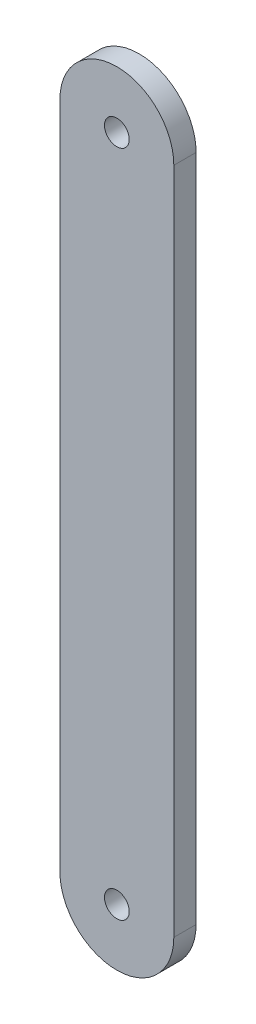
ISO-10303-21;
HEADER;
FILE_DESCRIPTION(('STEP AP214'),'2;1');
FILE_NAME('part.step','',(''),(''),'','','');
FILE_SCHEMA(('AUTOMOTIVE_DESIGN { 1 0 10303 214 1 1 1 1 }'));
ENDSEC;
DATA;
#1=APPLICATION_CONTEXT('core data for automotive mechanical design processes');
#2=APPLICATION_PROTOCOL_DEFINITION('international standard','automotive_design',2000,#1);
#3=PRODUCT_CONTEXT('',#1,'mechanical');
#4=PRODUCT('Part','Part','',(#3));
#5=PRODUCT_RELATED_PRODUCT_CATEGORY('part','',(#4));
#6=PRODUCT_DEFINITION_FORMATION('','',#4);
#7=PRODUCT_DEFINITION_CONTEXT('part definition',#1,'design');
#8=PRODUCT_DEFINITION('design','',#6,#7);
#9=PRODUCT_DEFINITION_SHAPE('','',#8);
#10=(LENGTH_UNIT() NAMED_UNIT(*) SI_UNIT(.MILLI.,.METRE.));
#11=(NAMED_UNIT(*) PLANE_ANGLE_UNIT() SI_UNIT($,.RADIAN.));
#12=(NAMED_UNIT(*) SI_UNIT($,.STERADIAN.) SOLID_ANGLE_UNIT());
#13=UNCERTAINTY_MEASURE_WITH_UNIT(LENGTH_MEASURE(1.E-05),#10,'distance_accuracy_value','');
#14=(GEOMETRIC_REPRESENTATION_CONTEXT(3) GLOBAL_UNCERTAINTY_ASSIGNED_CONTEXT((#13)) GLOBAL_UNIT_ASSIGNED_CONTEXT((#10,
#11,#12)) REPRESENTATION_CONTEXT('',''));
#15=CARTESIAN_POINT('',(0.,0.,0.));
#16=DIRECTION('',(0.,0.,1.));
#17=DIRECTION('',(1.,0.,0.));
#18=AXIS2_PLACEMENT_3D('',#15,#16,#17);
#19=CARTESIAN_POINT('',(12.78,0.,2.5));
#20=DIRECTION('',(-1.,0.,0.));
#21=DIRECTION('',(0.,-1.,0.));
#22=AXIS2_PLACEMENT_3D('',#19,#20,#21);
#23=PLANE('',#22);
#24=DIRECTION('',(0.,1.,0.));
#25=VECTOR('',#24,1.);
#26=CARTESIAN_POINT('',(12.78,0.,-2.5));
#27=LINE('',#26,#25);
#28=CARTESIAN_POINT('',(12.78,0.,-2.5));
#29=VERTEX_POINT('',#28);
#30=CARTESIAN_POINT('',(12.78,150.,-2.5));
#31=VERTEX_POINT('',#30);
#32=EDGE_CURVE('E105',#29,#31,#27,.T.);
#33=ORIENTED_EDGE('',*,*,#32,.T.);
#34=DIRECTION('',(0.,0.,-1.));
#35=VECTOR('',#34,1.);
#36=CARTESIAN_POINT('',(12.78,150.,2.5));
#37=LINE('',#36,#35);
#38=CARTESIAN_POINT('',(12.78,150.,2.5));
#39=VERTEX_POINT('',#38);
#40=EDGE_CURVE('E11',#39,#31,#37,.T.);
#41=ORIENTED_EDGE('',*,*,#40,.F.);
#42=DIRECTION('',(0.,1.,0.));
#43=VECTOR('',#42,1.);
#44=CARTESIAN_POINT('',(12.78,0.,2.5));
#45=LINE('',#44,#43);
#46=CARTESIAN_POINT('',(12.78,0.,2.5));
#47=VERTEX_POINT('',#46);
#48=EDGE_CURVE('E87',#47,#39,#45,.T.);
#49=ORIENTED_EDGE('',*,*,#48,.F.);
#50=DIRECTION('',(0.,0.,-1.));
#51=VECTOR('',#50,1.);
#52=CARTESIAN_POINT('',(12.78,0.,2.5));
#53=LINE('',#52,#51);
#54=EDGE_CURVE('E104',#47,#29,#53,.T.);
#55=ORIENTED_EDGE('',*,*,#54,.T.);
#56=EDGE_LOOP('',(#33,#41,#49,#55));
#57=FACE_BOUND('',#56,.T.);
#58=ADVANCED_FACE('F35',(#57),#23,.F.);
#59=CARTESIAN_POINT('',(0.,150.,2.5));
#60=DIRECTION('',(0.,0.,-1.));
#61=DIRECTION('',(-1.,0.,0.));
#62=AXIS2_PLACEMENT_3D('',#59,#60,#61);
#63=CYLINDRICAL_SURFACE('',#62,12.78);
#64=CARTESIAN_POINT('',(0.,150.,-2.5));
#65=DIRECTION('',(0.,0.,1.));
#66=DIRECTION('',(1.,0.,0.));
#67=AXIS2_PLACEMENT_3D('',#64,#65,#66);
#68=CIRCLE('',#67,12.78);
#69=CARTESIAN_POINT('',(-12.78,150.,-2.5));
#70=VERTEX_POINT('',#69);
#71=EDGE_CURVE('E91',#31,#70,#68,.T.);
#72=ORIENTED_EDGE('',*,*,#71,.T.);
#73=DIRECTION('',(0.,0.,-1.));
#74=VECTOR('',#73,1.);
#75=CARTESIAN_POINT('',(-12.78,150.,2.5));
#76=LINE('',#75,#74);
#77=CARTESIAN_POINT('',(-12.78,150.,2.5));
#78=VERTEX_POINT('',#77);
#79=EDGE_CURVE('E43',#78,#70,#76,.T.);
#80=ORIENTED_EDGE('',*,*,#79,.F.);
#81=CARTESIAN_POINT('',(0.,150.,2.5));
#82=DIRECTION('',(0.,0.,1.));
#83=DIRECTION('',(1.,0.,0.));
#84=AXIS2_PLACEMENT_3D('',#81,#82,#83);
#85=CIRCLE('',#84,12.78);
#86=EDGE_CURVE('E81',#39,#78,#85,.T.);
#87=ORIENTED_EDGE('',*,*,#86,.F.);
#88=ORIENTED_EDGE('',*,*,#40,.T.);
#89=EDGE_LOOP('',(#72,#80,#87,#88));
#90=FACE_BOUND('',#89,.T.);
#91=ADVANCED_FACE('F90',(#90),#63,.T.);
#92=CARTESIAN_POINT('',(-12.78,0.,2.5));
#93=DIRECTION('',(1.,0.,0.));
#94=DIRECTION('',(0.,1.,0.));
#95=AXIS2_PLACEMENT_3D('',#92,#93,#94);
#96=PLANE('',#95);
#97=DIRECTION('',(0.,-1.,0.));
#98=VECTOR('',#97,1.);
#99=CARTESIAN_POINT('',(-12.78,0.,-2.5));
#100=LINE('',#99,#98);
#101=CARTESIAN_POINT('',(-12.78,0.,-2.5));
#102=VERTEX_POINT('',#101);
#103=EDGE_CURVE('E68',#70,#102,#100,.T.);
#104=ORIENTED_EDGE('',*,*,#103,.T.);
#105=DIRECTION('',(0.,0.,-1.));
#106=VECTOR('',#105,1.);
#107=CARTESIAN_POINT('',(-12.78,0.,2.5));
#108=LINE('',#107,#106);
#109=CARTESIAN_POINT('',(-12.78,0.,2.5));
#110=VERTEX_POINT('',#109);
#111=EDGE_CURVE('E92',#110,#102,#108,.T.);
#112=ORIENTED_EDGE('',*,*,#111,.F.);
#113=DIRECTION('',(0.,-1.,0.));
#114=VECTOR('',#113,1.);
#115=CARTESIAN_POINT('',(-12.78,0.,2.5));
#116=LINE('',#115,#114);
#117=EDGE_CURVE('E85',#78,#110,#116,.T.);
#118=ORIENTED_EDGE('',*,*,#117,.F.);
#119=ORIENTED_EDGE('',*,*,#79,.T.);
#120=EDGE_LOOP('',(#104,#112,#118,#119));
#121=FACE_BOUND('',#120,.T.);
#122=ADVANCED_FACE('F93',(#121),#96,.F.);
#123=CARTESIAN_POINT('',(0.,0.,2.5));
#124=DIRECTION('',(0.,0.,-1.));
#125=DIRECTION('',(-1.,0.,0.));
#126=AXIS2_PLACEMENT_3D('',#123,#124,#125);
#127=CYLINDRICAL_SURFACE('',#126,2.78);
#128=CARTESIAN_POINT('',(0.,0.,2.5));
#129=DIRECTION('',(0.,0.,1.));
#130=DIRECTION('',(1.,0.,0.));
#131=AXIS2_PLACEMENT_3D('',#128,#129,#130);
#132=CIRCLE('',#131,2.78);
#133=CARTESIAN_POINT('',(2.78,0.,2.5));
#134=VERTEX_POINT('',#133);
#135=EDGE_CURVE('E95',#134,#134,#132,.T.);
#136=ORIENTED_EDGE('',*,*,#135,.T.);
#137=EDGE_LOOP('',(#136));
#138=FACE_BOUND('',#137,.T.);
#139=CARTESIAN_POINT('',(0.,0.,-2.5));
#140=DIRECTION('',(0.,0.,1.));
#141=DIRECTION('',(1.,0.,0.));
#142=AXIS2_PLACEMENT_3D('',#139,#140,#141);
#143=CIRCLE('',#142,2.78);
#144=CARTESIAN_POINT('',(2.78,0.,-2.5));
#145=VERTEX_POINT('',#144);
#146=EDGE_CURVE('E111',#145,#145,#143,.T.);
#147=ORIENTED_EDGE('',*,*,#146,.F.);
#148=EDGE_LOOP('',(#147));
#149=FACE_BOUND('',#148,.T.);
#150=ADVANCED_FACE('F131',(#138,#149),#127,.F.);
#151=CARTESIAN_POINT('',(0.,0.,2.5));
#152=DIRECTION('',(0.,0.,-1.));
#153=DIRECTION('',(-1.,0.,0.));
#154=AXIS2_PLACEMENT_3D('',#151,#152,#153);
#155=CYLINDRICAL_SURFACE('',#154,12.78);
#156=CARTESIAN_POINT('',(0.,0.,-2.5));
#157=DIRECTION('',(0.,0.,1.));
#158=DIRECTION('',(1.,0.,0.));
#159=AXIS2_PLACEMENT_3D('',#156,#157,#158);
#160=CIRCLE('',#159,12.78);
#161=EDGE_CURVE('E74',#102,#29,#160,.T.);
#162=ORIENTED_EDGE('',*,*,#161,.T.);
#163=ORIENTED_EDGE('',*,*,#54,.F.);
#164=CARTESIAN_POINT('',(0.,0.,2.5));
#165=DIRECTION('',(0.,0.,1.));
#166=DIRECTION('',(1.,0.,0.));
#167=AXIS2_PLACEMENT_3D('',#164,#165,#166);
#168=CIRCLE('',#167,12.78);
#169=EDGE_CURVE('E51',#110,#47,#168,.T.);
#170=ORIENTED_EDGE('',*,*,#169,.F.);
#171=ORIENTED_EDGE('',*,*,#111,.T.);
#172=EDGE_LOOP('',(#162,#163,#170,#171));
#173=FACE_BOUND('',#172,.T.);
#174=ADVANCED_FACE('F118',(#173),#155,.T.);
#175=CARTESIAN_POINT('',(0.,150.,2.5));
#176=DIRECTION('',(0.,0.,-1.));
#177=DIRECTION('',(-1.,0.,0.));
#178=AXIS2_PLACEMENT_3D('',#175,#176,#177);
#179=CYLINDRICAL_SURFACE('',#178,2.77999999999999);
#180=CARTESIAN_POINT('',(0.,150.,2.5));
#181=DIRECTION('',(0.,0.,1.));
#182=DIRECTION('',(1.,0.,0.));
#183=AXIS2_PLACEMENT_3D('',#180,#181,#182);
#184=CIRCLE('',#183,2.77999999999999);
#185=CARTESIAN_POINT('',(2.77999999999999,150.,2.5));
#186=VERTEX_POINT('',#185);
#187=EDGE_CURVE('E101',#186,#186,#184,.T.);
#188=ORIENTED_EDGE('',*,*,#187,.T.);
#189=EDGE_LOOP('',(#188));
#190=FACE_BOUND('',#189,.T.);
#191=CARTESIAN_POINT('',(0.,150.,-2.5));
#192=DIRECTION('',(0.,0.,1.));
#193=DIRECTION('',(1.,0.,0.));
#194=AXIS2_PLACEMENT_3D('',#191,#192,#193);
#195=CIRCLE('',#194,2.77999999999999);
#196=CARTESIAN_POINT('',(2.77999999999999,150.,-2.5));
#197=VERTEX_POINT('',#196);
#198=EDGE_CURVE('E114',#197,#197,#195,.T.);
#199=ORIENTED_EDGE('',*,*,#198,.F.);
#200=EDGE_LOOP('',(#199));
#201=FACE_BOUND('',#200,.T.);
#202=ADVANCED_FACE('F136',(#190,#201),#179,.F.);
#203=CARTESIAN_POINT('',(0.,0.,2.5));
#204=DIRECTION('',(0.,0.,1.));
#205=DIRECTION('',(1.,0.,0.));
#206=AXIS2_PLACEMENT_3D('',#203,#204,#205);
#207=PLANE('',#206);
#208=ORIENTED_EDGE('',*,*,#48,.T.);
#209=ORIENTED_EDGE('',*,*,#86,.T.);
#210=ORIENTED_EDGE('',*,*,#117,.T.);
#211=ORIENTED_EDGE('',*,*,#169,.T.);
#212=EDGE_LOOP('',(#208,#209,#210,#211));
#213=FACE_BOUND('',#212,.T.);
#214=ORIENTED_EDGE('',*,*,#135,.F.);
#215=EDGE_LOOP('',(#214));
#216=FACE_BOUND('',#215,.T.);
#217=ORIENTED_EDGE('',*,*,#187,.F.);
#218=EDGE_LOOP('',(#217));
#219=FACE_BOUND('',#218,.T.);
#220=ADVANCED_FACE('F82',(#213,#216,#219),#207,.T.);
#221=CARTESIAN_POINT('',(0.,0.,-2.5));
#222=DIRECTION('',(0.,0.,1.));
#223=DIRECTION('',(1.,0.,0.));
#224=AXIS2_PLACEMENT_3D('',#221,#222,#223);
#225=PLANE('',#224);
#226=ORIENTED_EDGE('',*,*,#32,.F.);
#227=ORIENTED_EDGE('',*,*,#161,.F.);
#228=ORIENTED_EDGE('',*,*,#103,.F.);
#229=ORIENTED_EDGE('',*,*,#71,.F.);
#230=EDGE_LOOP('',(#226,#227,#228,#229));
#231=FACE_BOUND('',#230,.T.);
#232=ORIENTED_EDGE('',*,*,#146,.T.);
#233=EDGE_LOOP('',(#232));
#234=FACE_BOUND('',#233,.T.);
#235=ORIENTED_EDGE('',*,*,#198,.T.);
#236=EDGE_LOOP('',(#235));
#237=FACE_BOUND('',#236,.T.);
#238=ADVANCED_FACE('F121',(#231,#234,#237),#225,.F.);
#239=CLOSED_SHELL('',(#58,#91,#122,#150,#174,#202,#220,#238));
#240=MANIFOLD_SOLID_BREP('B2',#239);
#241=ADVANCED_BREP_SHAPE_REPRESENTATION('',(#18,#240),#14);
#242=SHAPE_DEFINITION_REPRESENTATION(#9,#241);
ENDSEC;
END-ISO-10303-21;
